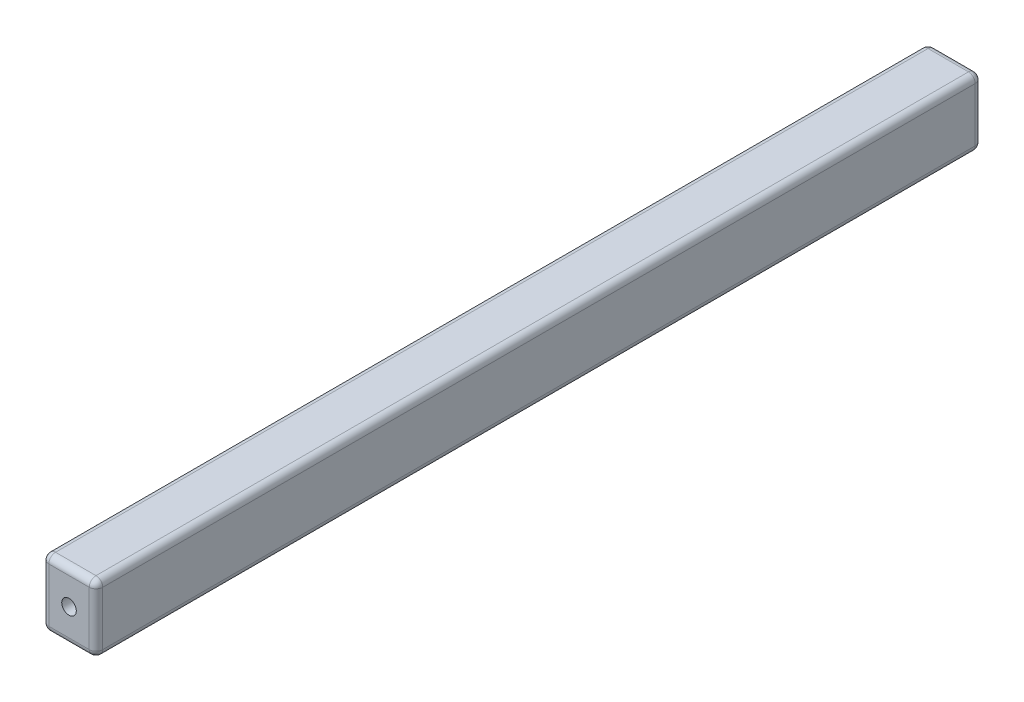
ISO-10303-21;
HEADER;
FILE_DESCRIPTION(('STEP AP214'),'2;1');
FILE_NAME('part.step','',(''),(''),'','','');
FILE_SCHEMA(('AUTOMOTIVE_DESIGN { 1 0 10303 214 1 1 1 1 }'));
ENDSEC;
DATA;
#1=APPLICATION_CONTEXT('core data for automotive mechanical design processes');
#2=APPLICATION_PROTOCOL_DEFINITION('international standard','automotive_design',2000,#1);
#3=PRODUCT_CONTEXT('',#1,'mechanical');
#4=PRODUCT('Part','Part','',(#3));
#5=PRODUCT_RELATED_PRODUCT_CATEGORY('part','',(#4));
#6=PRODUCT_DEFINITION_FORMATION('','',#4);
#7=PRODUCT_DEFINITION_CONTEXT('part definition',#1,'design');
#8=PRODUCT_DEFINITION('design','',#6,#7);
#9=PRODUCT_DEFINITION_SHAPE('','',#8);
#10=(LENGTH_UNIT() NAMED_UNIT(*) SI_UNIT(.MILLI.,.METRE.));
#11=(NAMED_UNIT(*) PLANE_ANGLE_UNIT() SI_UNIT($,.RADIAN.));
#12=(NAMED_UNIT(*) SI_UNIT($,.STERADIAN.) SOLID_ANGLE_UNIT());
#13=UNCERTAINTY_MEASURE_WITH_UNIT(LENGTH_MEASURE(1.E-05),#10,'distance_accuracy_value','');
#14=(GEOMETRIC_REPRESENTATION_CONTEXT(3) GLOBAL_UNCERTAINTY_ASSIGNED_CONTEXT((#13)) GLOBAL_UNIT_ASSIGNED_CONTEXT((#10,
#11,#12)) REPRESENTATION_CONTEXT('',''));
#15=CARTESIAN_POINT('',(0.,0.,0.));
#16=DIRECTION('',(0.,0.,1.));
#17=DIRECTION('',(1.,0.,0.));
#18=AXIS2_PLACEMENT_3D('',#15,#16,#17);
#19=CARTESIAN_POINT('',(-20.,-25.,328.45));
#20=DIRECTION('',(1.,0.,0.));
#21=DIRECTION('',(0.,0.,-1.));
#22=AXIS2_PLACEMENT_3D('',#19,#20,#21);
#23=PLANE('',#22);
#24=DIRECTION('',(0.,-1.,0.));
#25=VECTOR('',#24,1.);
#26=CARTESIAN_POINT('',(-20.,-25.,-323.45));
#27=LINE('',#26,#25);
#28=CARTESIAN_POINT('',(-20.,20.,-323.45));
#29=VERTEX_POINT('',#28);
#30=CARTESIAN_POINT('',(-20.,-20.,-323.45));
#31=VERTEX_POINT('',#30);
#32=EDGE_CURVE('E170',#29,#31,#27,.T.);
#33=ORIENTED_EDGE('',*,*,#32,.T.);
#34=DIRECTION('',(0.,0.,-1.));
#35=VECTOR('',#34,1.);
#36=CARTESIAN_POINT('',(-20.,-20.,328.45));
#37=LINE('',#36,#35);
#38=CARTESIAN_POINT('',(-20.,-20.,323.45));
#39=VERTEX_POINT('',#38);
#40=EDGE_CURVE('E172',#31,#39,#37,.F.);
#41=ORIENTED_EDGE('',*,*,#40,.T.);
#42=DIRECTION('',(0.,-1.,0.));
#43=VECTOR('',#42,1.);
#44=CARTESIAN_POINT('',(-20.,25.,323.45));
#45=LINE('',#44,#43);
#46=CARTESIAN_POINT('',(-20.,20.,323.45));
#47=VERTEX_POINT('',#46);
#48=EDGE_CURVE('E168',#39,#47,#45,.F.);
#49=ORIENTED_EDGE('',*,*,#48,.T.);
#50=DIRECTION('',(0.,0.,-1.));
#51=VECTOR('',#50,1.);
#52=CARTESIAN_POINT('',(-20.,20.,328.45));
#53=LINE('',#52,#51);
#54=EDGE_CURVE('E166',#47,#29,#53,.T.);
#55=ORIENTED_EDGE('',*,*,#54,.T.);
#56=EDGE_LOOP('',(#33,#41,#49,#55));
#57=FACE_BOUND('',#56,.T.);
#58=ADVANCED_FACE('F43',(#57),#23,.F.);
#59=CARTESIAN_POINT('',(20.,-25.,328.45));
#60=DIRECTION('',(0.,1.,0.));
#61=DIRECTION('',(-1.,0.,0.));
#62=AXIS2_PLACEMENT_3D('',#59,#60,#61);
#63=PLANE('',#62);
#64=DIRECTION('',(1.,0.,0.));
#65=VECTOR('',#64,1.);
#66=CARTESIAN_POINT('',(-20.,-25.,323.45));
#67=LINE('',#66,#65);
#68=CARTESIAN_POINT('',(15.,-25.,323.45));
#69=VERTEX_POINT('',#68);
#70=CARTESIAN_POINT('',(-15.,-25.,323.45));
#71=VERTEX_POINT('',#70);
#72=EDGE_CURVE('E159',#69,#71,#67,.F.);
#73=ORIENTED_EDGE('',*,*,#72,.T.);
#74=DIRECTION('',(0.,0.,-1.));
#75=VECTOR('',#74,1.);
#76=CARTESIAN_POINT('',(-15.,-25.,328.45));
#77=LINE('',#76,#75);
#78=CARTESIAN_POINT('',(-15.,-25.,-323.45));
#79=VERTEX_POINT('',#78);
#80=EDGE_CURVE('E163',#71,#79,#77,.T.);
#81=ORIENTED_EDGE('',*,*,#80,.T.);
#82=DIRECTION('',(1.,0.,0.));
#83=VECTOR('',#82,1.);
#84=CARTESIAN_POINT('',(20.,-25.,-323.45));
#85=LINE('',#84,#83);
#86=CARTESIAN_POINT('',(15.,-25.,-323.45));
#87=VERTEX_POINT('',#86);
#88=EDGE_CURVE('E161',#79,#87,#85,.T.);
#89=ORIENTED_EDGE('',*,*,#88,.T.);
#90=DIRECTION('',(0.,0.,-1.));
#91=VECTOR('',#90,1.);
#92=CARTESIAN_POINT('',(15.,-25.,328.45));
#93=LINE('',#92,#91);
#94=EDGE_CURVE('E157',#87,#69,#93,.F.);
#95=ORIENTED_EDGE('',*,*,#94,.T.);
#96=EDGE_LOOP('',(#73,#81,#89,#95));
#97=FACE_BOUND('',#96,.T.);
#98=ADVANCED_FACE('F355',(#97),#63,.F.);
#99=CARTESIAN_POINT('',(20.,-25.,328.45));
#100=DIRECTION('',(-1.,0.,0.));
#101=DIRECTION('',(0.,0.,1.));
#102=AXIS2_PLACEMENT_3D('',#99,#100,#101);
#103=PLANE('',#102);
#104=DIRECTION('',(0.,1.,0.));
#105=VECTOR('',#104,1.);
#106=CARTESIAN_POINT('',(20.,-25.,323.45));
#107=LINE('',#106,#105);
#108=CARTESIAN_POINT('',(20.,20.,323.45));
#109=VERTEX_POINT('',#108);
#110=CARTESIAN_POINT('',(20.,-20.,323.45));
#111=VERTEX_POINT('',#110);
#112=EDGE_CURVE('E197',#109,#111,#107,.F.);
#113=ORIENTED_EDGE('',*,*,#112,.T.);
#114=DIRECTION('',(0.,0.,-1.));
#115=VECTOR('',#114,1.);
#116=CARTESIAN_POINT('',(20.,-20.,328.45));
#117=LINE('',#116,#115);
#118=CARTESIAN_POINT('',(20.,-20.,-323.45));
#119=VERTEX_POINT('',#118);
#120=EDGE_CURVE('E199',#111,#119,#117,.T.);
#121=ORIENTED_EDGE('',*,*,#120,.T.);
#122=DIRECTION('',(0.,1.,0.));
#123=VECTOR('',#122,1.);
#124=CARTESIAN_POINT('',(20.,-25.,-323.45));
#125=LINE('',#124,#123);
#126=CARTESIAN_POINT('',(20.,20.,-323.45));
#127=VERTEX_POINT('',#126);
#128=EDGE_CURVE('E195',#119,#127,#125,.T.);
#129=ORIENTED_EDGE('',*,*,#128,.T.);
#130=DIRECTION('',(0.,0.,-1.));
#131=VECTOR('',#130,1.);
#132=CARTESIAN_POINT('',(20.,20.,328.45));
#133=LINE('',#132,#131);
#134=EDGE_CURVE('E193',#127,#109,#133,.F.);
#135=ORIENTED_EDGE('',*,*,#134,.T.);
#136=EDGE_LOOP('',(#113,#121,#129,#135));
#137=FACE_BOUND('',#136,.T.);
#138=ADVANCED_FACE('F296',(#137),#103,.F.);
#139=CARTESIAN_POINT('',(20.,25.,328.45));
#140=DIRECTION('',(0.,-1.,0.));
#141=DIRECTION('',(1.,0.,0.));
#142=AXIS2_PLACEMENT_3D('',#139,#140,#141);
#143=PLANE('',#142);
#144=DIRECTION('',(-1.,0.,0.));
#145=VECTOR('',#144,1.);
#146=CARTESIAN_POINT('',(20.,25.,323.45));
#147=LINE('',#146,#145);
#148=CARTESIAN_POINT('',(-15.,25.,323.45));
#149=VERTEX_POINT('',#148);
#150=CARTESIAN_POINT('',(15.,25.,323.45));
#151=VERTEX_POINT('',#150);
#152=EDGE_CURVE('E52',#149,#151,#147,.F.);
#153=ORIENTED_EDGE('',*,*,#152,.T.);
#154=DIRECTION('',(0.,0.,-1.));
#155=VECTOR('',#154,1.);
#156=CARTESIAN_POINT('',(15.,25.,328.45));
#157=LINE('',#156,#155);
#158=CARTESIAN_POINT('',(15.,25.,-323.45));
#159=VERTEX_POINT('',#158);
#160=EDGE_CURVE('E11',#151,#159,#157,.T.);
#161=ORIENTED_EDGE('',*,*,#160,.T.);
#162=DIRECTION('',(-1.,0.,0.));
#163=VECTOR('',#162,1.);
#164=CARTESIAN_POINT('',(20.,25.,-323.45));
#165=LINE('',#164,#163);
#166=CARTESIAN_POINT('',(-15.,25.,-323.45));
#167=VERTEX_POINT('',#166);
#168=EDGE_CURVE('E202',#159,#167,#165,.T.);
#169=ORIENTED_EDGE('',*,*,#168,.T.);
#170=DIRECTION('',(0.,0.,-1.));
#171=VECTOR('',#170,1.);
#172=CARTESIAN_POINT('',(-15.,25.,328.45));
#173=LINE('',#172,#171);
#174=EDGE_CURVE('E63',#167,#149,#173,.F.);
#175=ORIENTED_EDGE('',*,*,#174,.T.);
#176=EDGE_LOOP('',(#153,#161,#169,#175));
#177=FACE_BOUND('',#176,.T.);
#178=ADVANCED_FACE('F310',(#177),#143,.F.);
#179=CARTESIAN_POINT('',(0.,0.,328.45));
#180=DIRECTION('',(0.,0.,1.));
#181=DIRECTION('',(1.,0.,0.));
#182=AXIS2_PLACEMENT_3D('',#179,#180,#181);
#183=PLANE('',#182);
#184=CARTESIAN_POINT('',(0.,0.,328.45));
#185=DIRECTION('',(0.,0.,1.));
#186=DIRECTION('',(1.,0.,0.));
#187=AXIS2_PLACEMENT_3D('',#184,#185,#186);
#188=CIRCLE('',#187,5.4);
#189=CARTESIAN_POINT('',(5.4,0.,328.45));
#190=VERTEX_POINT('',#189);
#191=EDGE_CURVE('E145',#190,#190,#188,.T.);
#192=ORIENTED_EDGE('',*,*,#191,.F.);
#193=EDGE_LOOP('',(#192));
#194=FACE_BOUND('',#193,.T.);
#195=DIRECTION('',(0.,-1.,0.));
#196=VECTOR('',#195,1.);
#197=CARTESIAN_POINT('',(-15.,-25.,328.45));
#198=LINE('',#197,#196);
#199=CARTESIAN_POINT('',(-15.,20.,328.45));
#200=VERTEX_POINT('',#199);
#201=CARTESIAN_POINT('',(-15.,-20.,328.45));
#202=VERTEX_POINT('',#201);
#203=EDGE_CURVE('E188',#200,#202,#198,.T.);
#204=ORIENTED_EDGE('',*,*,#203,.T.);
#205=DIRECTION('',(1.,0.,0.));
#206=VECTOR('',#205,1.);
#207=CARTESIAN_POINT('',(20.,-20.,328.45));
#208=LINE('',#207,#206);
#209=CARTESIAN_POINT('',(15.,-20.,328.45));
#210=VERTEX_POINT('',#209);
#211=EDGE_CURVE('E190',#202,#210,#208,.T.);
#212=ORIENTED_EDGE('',*,*,#211,.T.);
#213=DIRECTION('',(0.,1.,0.));
#214=VECTOR('',#213,1.);
#215=CARTESIAN_POINT('',(15.,25.,328.45));
#216=LINE('',#215,#214);
#217=CARTESIAN_POINT('',(15.,20.,328.45));
#218=VERTEX_POINT('',#217);
#219=EDGE_CURVE('E186',#210,#218,#216,.T.);
#220=ORIENTED_EDGE('',*,*,#219,.T.);
#221=DIRECTION('',(-1.,0.,0.));
#222=VECTOR('',#221,1.);
#223=CARTESIAN_POINT('',(-20.,20.,328.45));
#224=LINE('',#223,#222);
#225=EDGE_CURVE('E184',#218,#200,#224,.T.);
#226=ORIENTED_EDGE('',*,*,#225,.T.);
#227=EDGE_LOOP('',(#204,#212,#220,#226));
#228=FACE_BOUND('',#227,.T.);
#229=ADVANCED_FACE('F287',(#194,#228),#183,.T.);
#230=CARTESIAN_POINT('',(0.,0.,-328.45));
#231=DIRECTION('',(0.,0.,1.));
#232=DIRECTION('',(1.,0.,0.));
#233=AXIS2_PLACEMENT_3D('',#230,#231,#232);
#234=PLANE('',#233);
#235=CARTESIAN_POINT('',(0.,0.,-328.45));
#236=DIRECTION('',(0.,0.,-1.));
#237=DIRECTION('',(-1.,0.,0.));
#238=AXIS2_PLACEMENT_3D('',#235,#236,#237);
#239=CIRCLE('',#238,5.4);
#240=CARTESIAN_POINT('',(-5.4,0.,-328.45));
#241=VERTEX_POINT('',#240);
#242=EDGE_CURVE('E146',#241,#241,#239,.T.);
#243=ORIENTED_EDGE('',*,*,#242,.F.);
#244=EDGE_LOOP('',(#243));
#245=FACE_BOUND('',#244,.T.);
#246=DIRECTION('',(0.,1.,0.));
#247=VECTOR('',#246,1.);
#248=CARTESIAN_POINT('',(15.,0.,-328.45));
#249=LINE('',#248,#247);
#250=CARTESIAN_POINT('',(15.,20.,-328.45));
#251=VERTEX_POINT('',#250);
#252=CARTESIAN_POINT('',(15.,-20.,-328.45));
#253=VERTEX_POINT('',#252);
#254=EDGE_CURVE('E177',#251,#253,#249,.F.);
#255=ORIENTED_EDGE('',*,*,#254,.T.);
#256=DIRECTION('',(1.,0.,0.));
#257=VECTOR('',#256,1.);
#258=CARTESIAN_POINT('',(0.,-20.,-328.45));
#259=LINE('',#258,#257);
#260=CARTESIAN_POINT('',(-15.,-20.,-328.45));
#261=VERTEX_POINT('',#260);
#262=EDGE_CURVE('E181',#253,#261,#259,.F.);
#263=ORIENTED_EDGE('',*,*,#262,.T.);
#264=DIRECTION('',(0.,-1.,0.));
#265=VECTOR('',#264,1.);
#266=CARTESIAN_POINT('',(-15.,0.,-328.45));
#267=LINE('',#266,#265);
#268=CARTESIAN_POINT('',(-15.,20.,-328.45));
#269=VERTEX_POINT('',#268);
#270=EDGE_CURVE('E179',#261,#269,#267,.F.);
#271=ORIENTED_EDGE('',*,*,#270,.T.);
#272=DIRECTION('',(-1.,0.,0.));
#273=VECTOR('',#272,1.);
#274=CARTESIAN_POINT('',(0.,20.,-328.45));
#275=LINE('',#274,#273);
#276=EDGE_CURVE('E175',#269,#251,#275,.F.);
#277=ORIENTED_EDGE('',*,*,#276,.T.);
#278=EDGE_LOOP('',(#255,#263,#271,#277));
#279=FACE_BOUND('',#278,.T.);
#280=ADVANCED_FACE('F433',(#245,#279),#234,.F.);
#281=CARTESIAN_POINT('',(15.,20.,328.45));
#282=DIRECTION('',(0.,0.,-1.));
#283=DIRECTION('',(-1.,0.,0.));
#284=AXIS2_PLACEMENT_3D('',#281,#282,#283);
#285=CYLINDRICAL_SURFACE('',#284,5.);
#286=CARTESIAN_POINT('',(15.,20.,323.45));
#287=DIRECTION('',(0.,0.,1.));
#288=DIRECTION('',(1.,0.,0.));
#289=AXIS2_PLACEMENT_3D('',#286,#287,#288);
#290=CIRCLE('',#289,5.);
#291=EDGE_CURVE('E47',#109,#151,#290,.T.);
#292=ORIENTED_EDGE('',*,*,#291,.F.);
#293=ORIENTED_EDGE('',*,*,#134,.F.);
#294=CARTESIAN_POINT('',(15.,20.,-323.45));
#295=DIRECTION('',(0.,0.,-1.));
#296=DIRECTION('',(-1.,0.,0.));
#297=AXIS2_PLACEMENT_3D('',#294,#295,#296);
#298=CIRCLE('',#297,5.);
#299=EDGE_CURVE('E265',#159,#127,#298,.T.);
#300=ORIENTED_EDGE('',*,*,#299,.F.);
#301=ORIENTED_EDGE('',*,*,#160,.F.);
#302=EDGE_LOOP('',(#292,#293,#300,#301));
#303=FACE_BOUND('',#302,.T.);
#304=ADVANCED_FACE('F45',(#303),#285,.T.);
#305=CARTESIAN_POINT('',(15.,20.,323.45));
#306=DIRECTION('',(0.,1.,0.));
#307=DIRECTION('',(-1.,0.,0.));
#308=AXIS2_PLACEMENT_3D('',#305,#306,#307);
#309=SPHERICAL_SURFACE('',#308,5.);
#310=CARTESIAN_POINT('',(15.,20.,323.45));
#311=DIRECTION('',(0.,1.,0.));
#312=DIRECTION('',(-1.,0.,0.));
#313=AXIS2_PLACEMENT_3D('',#310,#311,#312);
#314=CIRCLE('',#313,5.);
#315=EDGE_CURVE('E260',#109,#218,#314,.F.);
#316=ORIENTED_EDGE('',*,*,#315,.F.);
#317=ORIENTED_EDGE('',*,*,#291,.T.);
#318=CARTESIAN_POINT('',(15.,20.,323.45));
#319=DIRECTION('',(1.,0.,0.));
#320=DIRECTION('',(0.,0.,-1.));
#321=AXIS2_PLACEMENT_3D('',#318,#319,#320);
#322=CIRCLE('',#321,5.);
#323=EDGE_CURVE('E263',#218,#151,#322,.F.);
#324=ORIENTED_EDGE('',*,*,#323,.F.);
#325=EDGE_LOOP('',(#316,#317,#324));
#326=FACE_BOUND('',#325,.T.);
#327=ADVANCED_FACE('F276',(#326),#309,.T.);
#328=CARTESIAN_POINT('',(15.,20.,-323.45));
#329=DIRECTION('',(1.,0.,0.));
#330=DIRECTION('',(0.,0.,-1.));
#331=AXIS2_PLACEMENT_3D('',#328,#329,#330);
#332=SPHERICAL_SURFACE('',#331,5.);
#333=CARTESIAN_POINT('',(15.,20.,-323.45));
#334=DIRECTION('',(1.,0.,0.));
#335=DIRECTION('',(0.,1.,0.));
#336=AXIS2_PLACEMENT_3D('',#333,#334,#335);
#337=CIRCLE('',#336,5.);
#338=EDGE_CURVE('E254',#159,#251,#337,.F.);
#339=ORIENTED_EDGE('',*,*,#338,.F.);
#340=ORIENTED_EDGE('',*,*,#299,.T.);
#341=CARTESIAN_POINT('',(15.,20.,-323.45));
#342=DIRECTION('',(0.,1.,0.));
#343=DIRECTION('',(0.,0.,1.));
#344=AXIS2_PLACEMENT_3D('',#341,#342,#343);
#345=CIRCLE('',#344,5.);
#346=EDGE_CURVE('E257',#251,#127,#345,.F.);
#347=ORIENTED_EDGE('',*,*,#346,.F.);
#348=EDGE_LOOP('',(#339,#340,#347));
#349=FACE_BOUND('',#348,.T.);
#350=ADVANCED_FACE('F540',(#349),#332,.T.);
#351=CARTESIAN_POINT('',(0.,20.,323.45));
#352=DIRECTION('',(1.,0.,0.));
#353=DIRECTION('',(0.,1.,0.));
#354=AXIS2_PLACEMENT_3D('',#351,#352,#353);
#355=CYLINDRICAL_SURFACE('',#354,5.);
#356=ORIENTED_EDGE('',*,*,#323,.T.);
#357=ORIENTED_EDGE('',*,*,#152,.F.);
#358=CARTESIAN_POINT('',(-15.,20.,323.45));
#359=DIRECTION('',(-1.,0.,0.));
#360=DIRECTION('',(0.,0.,1.));
#361=AXIS2_PLACEMENT_3D('',#358,#359,#360);
#362=CIRCLE('',#361,5.);
#363=EDGE_CURVE('E248',#200,#149,#362,.T.);
#364=ORIENTED_EDGE('',*,*,#363,.F.);
#365=ORIENTED_EDGE('',*,*,#225,.F.);
#366=EDGE_LOOP('',(#356,#357,#364,#365));
#367=FACE_BOUND('',#366,.T.);
#368=ADVANCED_FACE('F282',(#367),#355,.T.);
#369=CARTESIAN_POINT('',(15.,0.,323.45));
#370=DIRECTION('',(0.,-1.,0.));
#371=DIRECTION('',(0.,0.,-1.));
#372=AXIS2_PLACEMENT_3D('',#369,#370,#371);
#373=CYLINDRICAL_SURFACE('',#372,5.);
#374=ORIENTED_EDGE('',*,*,#315,.T.);
#375=ORIENTED_EDGE('',*,*,#219,.F.);
#376=CARTESIAN_POINT('',(15.,-20.,323.45));
#377=DIRECTION('',(0.,-1.,0.));
#378=DIRECTION('',(0.,0.,-1.));
#379=AXIS2_PLACEMENT_3D('',#376,#377,#378);
#380=CIRCLE('',#379,5.);
#381=EDGE_CURVE('E245',#111,#210,#380,.T.);
#382=ORIENTED_EDGE('',*,*,#381,.F.);
#383=ORIENTED_EDGE('',*,*,#112,.F.);
#384=EDGE_LOOP('',(#374,#375,#382,#383));
#385=FACE_BOUND('',#384,.T.);
#386=ADVANCED_FACE('F293',(#385),#373,.T.);
#387=CARTESIAN_POINT('',(15.,-20.,328.45));
#388=DIRECTION('',(0.,0.,-1.));
#389=DIRECTION('',(-1.,0.,0.));
#390=AXIS2_PLACEMENT_3D('',#387,#388,#389);
#391=CYLINDRICAL_SURFACE('',#390,5.);
#392=CARTESIAN_POINT('',(15.,-20.,-323.45));
#393=DIRECTION('',(0.,0.,-1.));
#394=DIRECTION('',(-1.,0.,0.));
#395=AXIS2_PLACEMENT_3D('',#392,#393,#394);
#396=CIRCLE('',#395,5.);
#397=EDGE_CURVE('E239',#119,#87,#396,.T.);
#398=ORIENTED_EDGE('',*,*,#397,.F.);
#399=ORIENTED_EDGE('',*,*,#120,.F.);
#400=CARTESIAN_POINT('',(15.,-20.,323.45));
#401=DIRECTION('',(0.,0.,1.));
#402=DIRECTION('',(1.,0.,0.));
#403=AXIS2_PLACEMENT_3D('',#400,#401,#402);
#404=CIRCLE('',#403,5.);
#405=EDGE_CURVE('E242',#69,#111,#404,.T.);
#406=ORIENTED_EDGE('',*,*,#405,.F.);
#407=ORIENTED_EDGE('',*,*,#94,.F.);
#408=EDGE_LOOP('',(#398,#399,#406,#407));
#409=FACE_BOUND('',#408,.T.);
#410=ADVANCED_FACE('F300',(#409),#391,.T.);
#411=CARTESIAN_POINT('',(15.,-25.,-323.45));
#412=DIRECTION('',(0.,1.,0.));
#413=DIRECTION('',(0.,0.,1.));
#414=AXIS2_PLACEMENT_3D('',#411,#412,#413);
#415=CYLINDRICAL_SURFACE('',#414,5.);
#416=ORIENTED_EDGE('',*,*,#346,.T.);
#417=ORIENTED_EDGE('',*,*,#128,.F.);
#418=CARTESIAN_POINT('',(15.,-20.,-323.45));
#419=DIRECTION('',(0.,-1.,0.));
#420=DIRECTION('',(0.,0.,-1.));
#421=AXIS2_PLACEMENT_3D('',#418,#419,#420);
#422=CIRCLE('',#421,5.);
#423=EDGE_CURVE('E237',#253,#119,#422,.T.);
#424=ORIENTED_EDGE('',*,*,#423,.F.);
#425=ORIENTED_EDGE('',*,*,#254,.F.);
#426=EDGE_LOOP('',(#416,#417,#424,#425));
#427=FACE_BOUND('',#426,.T.);
#428=ADVANCED_FACE('F308',(#427),#415,.T.);
#429=CARTESIAN_POINT('',(20.,20.,-323.45));
#430=DIRECTION('',(-1.,0.,0.));
#431=DIRECTION('',(0.,-1.,0.));
#432=AXIS2_PLACEMENT_3D('',#429,#430,#431);
#433=CYLINDRICAL_SURFACE('',#432,5.);
#434=ORIENTED_EDGE('',*,*,#338,.T.);
#435=ORIENTED_EDGE('',*,*,#276,.F.);
#436=CARTESIAN_POINT('',(-15.,20.,-323.45));
#437=DIRECTION('',(-1.,0.,0.));
#438=DIRECTION('',(0.,0.,1.));
#439=AXIS2_PLACEMENT_3D('',#436,#437,#438);
#440=CIRCLE('',#439,5.);
#441=EDGE_CURVE('E234',#167,#269,#440,.T.);
#442=ORIENTED_EDGE('',*,*,#441,.F.);
#443=ORIENTED_EDGE('',*,*,#168,.F.);
#444=EDGE_LOOP('',(#434,#435,#442,#443));
#445=FACE_BOUND('',#444,.T.);
#446=ADVANCED_FACE('F319',(#445),#433,.T.);
#447=CARTESIAN_POINT('',(-15.,20.,328.45));
#448=DIRECTION('',(0.,0.,-1.));
#449=DIRECTION('',(-1.,0.,0.));
#450=AXIS2_PLACEMENT_3D('',#447,#448,#449);
#451=CYLINDRICAL_SURFACE('',#450,5.);
#452=CARTESIAN_POINT('',(-15.,20.,323.45));
#453=DIRECTION('',(0.,0.,1.));
#454=DIRECTION('',(1.,0.,0.));
#455=AXIS2_PLACEMENT_3D('',#452,#453,#454);
#456=CIRCLE('',#455,5.);
#457=EDGE_CURVE('E251',#149,#47,#456,.T.);
#458=ORIENTED_EDGE('',*,*,#457,.F.);
#459=ORIENTED_EDGE('',*,*,#174,.F.);
#460=CARTESIAN_POINT('',(-15.,20.,-323.45));
#461=DIRECTION('',(0.,0.,-1.));
#462=DIRECTION('',(-1.,0.,0.));
#463=AXIS2_PLACEMENT_3D('',#460,#461,#462);
#464=CIRCLE('',#463,5.);
#465=EDGE_CURVE('E231',#29,#167,#464,.T.);
#466=ORIENTED_EDGE('',*,*,#465,.F.);
#467=ORIENTED_EDGE('',*,*,#54,.F.);
#468=EDGE_LOOP('',(#458,#459,#466,#467));
#469=FACE_BOUND('',#468,.T.);
#470=ADVANCED_FACE('F315',(#469),#451,.T.);
#471=CARTESIAN_POINT('',(-15.,20.,323.45));
#472=DIRECTION('',(0.,1.,0.));
#473=DIRECTION('',(0.,0.,1.));
#474=AXIS2_PLACEMENT_3D('',#471,#472,#473);
#475=SPHERICAL_SURFACE('',#474,5.);
#476=ORIENTED_EDGE('',*,*,#363,.T.);
#477=ORIENTED_EDGE('',*,*,#457,.T.);
#478=CARTESIAN_POINT('',(-15.,20.,323.45));
#479=DIRECTION('',(0.,1.,0.));
#480=DIRECTION('',(0.,0.,1.));
#481=AXIS2_PLACEMENT_3D('',#478,#479,#480);
#482=CIRCLE('',#481,5.);
#483=EDGE_CURVE('E228',#200,#47,#482,.F.);
#484=ORIENTED_EDGE('',*,*,#483,.F.);
#485=EDGE_LOOP('',(#476,#477,#484));
#486=FACE_BOUND('',#485,.T.);
#487=ADVANCED_FACE('F331',(#486),#475,.T.);
#488=CARTESIAN_POINT('',(15.,-20.,323.45));
#489=DIRECTION('',(1.,0.,0.));
#490=DIRECTION('',(0.,0.,-1.));
#491=AXIS2_PLACEMENT_3D('',#488,#489,#490);
#492=SPHERICAL_SURFACE('',#491,5.);
#493=ORIENTED_EDGE('',*,*,#405,.T.);
#494=ORIENTED_EDGE('',*,*,#381,.T.);
#495=CARTESIAN_POINT('',(15.,-20.,323.45));
#496=DIRECTION('',(1.,0.,0.));
#497=DIRECTION('',(0.,0.,-1.));
#498=AXIS2_PLACEMENT_3D('',#495,#496,#497);
#499=CIRCLE('',#498,5.);
#500=EDGE_CURVE('E226',#69,#210,#499,.F.);
#501=ORIENTED_EDGE('',*,*,#500,.F.);
#502=EDGE_LOOP('',(#493,#494,#501));
#503=FACE_BOUND('',#502,.T.);
#504=ADVANCED_FACE('F344',(#503),#492,.T.);
#505=CARTESIAN_POINT('',(15.,-20.,-323.45));
#506=DIRECTION('',(1.,0.,0.));
#507=DIRECTION('',(0.,0.,-1.));
#508=AXIS2_PLACEMENT_3D('',#505,#506,#507);
#509=SPHERICAL_SURFACE('',#508,5.);
#510=ORIENTED_EDGE('',*,*,#423,.T.);
#511=ORIENTED_EDGE('',*,*,#397,.T.);
#512=CARTESIAN_POINT('',(15.,-20.,-323.45));
#513=DIRECTION('',(1.,0.,0.));
#514=DIRECTION('',(0.,0.,-1.));
#515=AXIS2_PLACEMENT_3D('',#512,#513,#514);
#516=CIRCLE('',#515,5.);
#517=EDGE_CURVE('E223',#253,#87,#516,.F.);
#518=ORIENTED_EDGE('',*,*,#517,.F.);
#519=EDGE_LOOP('',(#510,#511,#518));
#520=FACE_BOUND('',#519,.T.);
#521=ADVANCED_FACE('F346',(#520),#509,.T.);
#522=CARTESIAN_POINT('',(-15.,20.,-323.45));
#523=DIRECTION('',(0.,1.,0.));
#524=DIRECTION('',(0.,0.,1.));
#525=AXIS2_PLACEMENT_3D('',#522,#523,#524);
#526=SPHERICAL_SURFACE('',#525,5.);
#527=ORIENTED_EDGE('',*,*,#465,.T.);
#528=ORIENTED_EDGE('',*,*,#441,.T.);
#529=CARTESIAN_POINT('',(-15.,20.,-323.45));
#530=DIRECTION('',(0.,1.,0.));
#531=DIRECTION('',(-1.,0.,0.));
#532=AXIS2_PLACEMENT_3D('',#529,#530,#531);
#533=CIRCLE('',#532,5.);
#534=EDGE_CURVE('E220',#29,#269,#533,.F.);
#535=ORIENTED_EDGE('',*,*,#534,.F.);
#536=EDGE_LOOP('',(#527,#528,#535));
#537=FACE_BOUND('',#536,.T.);
#538=ADVANCED_FACE('F321',(#537),#526,.T.);
#539=CARTESIAN_POINT('',(-15.,0.,323.45));
#540=DIRECTION('',(0.,1.,0.));
#541=DIRECTION('',(0.,0.,1.));
#542=AXIS2_PLACEMENT_3D('',#539,#540,#541);
#543=CYLINDRICAL_SURFACE('',#542,5.);
#544=ORIENTED_EDGE('',*,*,#483,.T.);
#545=ORIENTED_EDGE('',*,*,#48,.F.);
#546=CARTESIAN_POINT('',(-15.,-20.,323.45));
#547=DIRECTION('',(0.,-1.,0.));
#548=DIRECTION('',(0.,0.,-1.));
#549=AXIS2_PLACEMENT_3D('',#546,#547,#548);
#550=CIRCLE('',#549,5.);
#551=EDGE_CURVE('E217',#202,#39,#550,.T.);
#552=ORIENTED_EDGE('',*,*,#551,.F.);
#553=ORIENTED_EDGE('',*,*,#203,.F.);
#554=EDGE_LOOP('',(#544,#545,#552,#553));
#555=FACE_BOUND('',#554,.T.);
#556=ADVANCED_FACE('F333',(#555),#543,.T.);
#557=CARTESIAN_POINT('',(0.,-20.,323.45));
#558=DIRECTION('',(-1.,0.,0.));
#559=DIRECTION('',(0.,-1.,0.));
#560=AXIS2_PLACEMENT_3D('',#557,#558,#559);
#561=CYLINDRICAL_SURFACE('',#560,5.);
#562=ORIENTED_EDGE('',*,*,#500,.T.);
#563=ORIENTED_EDGE('',*,*,#211,.F.);
#564=CARTESIAN_POINT('',(-15.,-20.,323.45));
#565=DIRECTION('',(-1.,0.,0.));
#566=DIRECTION('',(0.,0.,1.));
#567=AXIS2_PLACEMENT_3D('',#564,#565,#566);
#568=CIRCLE('',#567,5.);
#569=EDGE_CURVE('E214',#71,#202,#568,.T.);
#570=ORIENTED_EDGE('',*,*,#569,.F.);
#571=ORIENTED_EDGE('',*,*,#72,.F.);
#572=EDGE_LOOP('',(#562,#563,#570,#571));
#573=FACE_BOUND('',#572,.T.);
#574=ADVANCED_FACE('F342',(#573),#561,.T.);
#575=CARTESIAN_POINT('',(20.,-20.,-323.45));
#576=DIRECTION('',(1.,0.,0.));
#577=DIRECTION('',(0.,1.,0.));
#578=AXIS2_PLACEMENT_3D('',#575,#576,#577);
#579=CYLINDRICAL_SURFACE('',#578,5.);
#580=ORIENTED_EDGE('',*,*,#517,.T.);
#581=ORIENTED_EDGE('',*,*,#88,.F.);
#582=CARTESIAN_POINT('',(-15.,-20.,-323.45));
#583=DIRECTION('',(-1.,0.,0.));
#584=DIRECTION('',(0.,-1.,0.));
#585=AXIS2_PLACEMENT_3D('',#582,#583,#584);
#586=CIRCLE('',#585,5.);
#587=EDGE_CURVE('E211',#261,#79,#586,.T.);
#588=ORIENTED_EDGE('',*,*,#587,.F.);
#589=ORIENTED_EDGE('',*,*,#262,.F.);
#590=EDGE_LOOP('',(#580,#581,#588,#589));
#591=FACE_BOUND('',#590,.T.);
#592=ADVANCED_FACE('F377',(#591),#579,.T.);
#593=CARTESIAN_POINT('',(-15.,-25.,-323.45));
#594=DIRECTION('',(0.,-1.,0.));
#595=DIRECTION('',(0.,0.,-1.));
#596=AXIS2_PLACEMENT_3D('',#593,#594,#595);
#597=CYLINDRICAL_SURFACE('',#596,5.);
#598=ORIENTED_EDGE('',*,*,#534,.T.);
#599=ORIENTED_EDGE('',*,*,#270,.F.);
#600=CARTESIAN_POINT('',(-15.,-20.,-323.45));
#601=DIRECTION('',(0.,-1.,0.));
#602=DIRECTION('',(0.,0.,-1.));
#603=AXIS2_PLACEMENT_3D('',#600,#601,#602);
#604=CIRCLE('',#603,5.);
#605=EDGE_CURVE('E209',#31,#261,#604,.T.);
#606=ORIENTED_EDGE('',*,*,#605,.F.);
#607=ORIENTED_EDGE('',*,*,#32,.F.);
#608=EDGE_LOOP('',(#598,#599,#606,#607));
#609=FACE_BOUND('',#608,.T.);
#610=ADVANCED_FACE('F326',(#609),#597,.T.);
#611=CARTESIAN_POINT('',(-15.,-20.,323.45));
#612=DIRECTION('',(0.,0.,1.));
#613=DIRECTION('',(1.,0.,0.));
#614=AXIS2_PLACEMENT_3D('',#611,#612,#613);
#615=SPHERICAL_SURFACE('',#614,5.);
#616=ORIENTED_EDGE('',*,*,#569,.T.);
#617=ORIENTED_EDGE('',*,*,#551,.T.);
#618=CARTESIAN_POINT('',(-15.,-20.,323.45));
#619=DIRECTION('',(0.,0.,1.));
#620=DIRECTION('',(1.,0.,0.));
#621=AXIS2_PLACEMENT_3D('',#618,#619,#620);
#622=CIRCLE('',#621,5.);
#623=EDGE_CURVE('E207',#71,#39,#622,.F.);
#624=ORIENTED_EDGE('',*,*,#623,.F.);
#625=EDGE_LOOP('',(#616,#617,#624));
#626=FACE_BOUND('',#625,.T.);
#627=ADVANCED_FACE('F338',(#626),#615,.T.);
#628=CARTESIAN_POINT('',(-15.,-20.,-323.45));
#629=DIRECTION('',(0.,0.,-1.));
#630=DIRECTION('',(-1.,0.,0.));
#631=AXIS2_PLACEMENT_3D('',#628,#629,#630);
#632=SPHERICAL_SURFACE('',#631,5.);
#633=ORIENTED_EDGE('',*,*,#605,.T.);
#634=ORIENTED_EDGE('',*,*,#587,.T.);
#635=CARTESIAN_POINT('',(-15.,-20.,-323.45));
#636=DIRECTION('',(0.,0.,-1.));
#637=DIRECTION('',(-1.,0.,0.));
#638=AXIS2_PLACEMENT_3D('',#635,#636,#637);
#639=CIRCLE('',#638,5.);
#640=EDGE_CURVE('E156',#31,#79,#639,.F.);
#641=ORIENTED_EDGE('',*,*,#640,.F.);
#642=EDGE_LOOP('',(#633,#634,#641));
#643=FACE_BOUND('',#642,.T.);
#644=ADVANCED_FACE('F368',(#643),#632,.T.);
#645=CARTESIAN_POINT('',(-15.,-20.,328.45));
#646=DIRECTION('',(0.,0.,-1.));
#647=DIRECTION('',(-1.,0.,0.));
#648=AXIS2_PLACEMENT_3D('',#645,#646,#647);
#649=CYLINDRICAL_SURFACE('',#648,5.);
#650=ORIENTED_EDGE('',*,*,#623,.T.);
#651=ORIENTED_EDGE('',*,*,#40,.F.);
#652=ORIENTED_EDGE('',*,*,#640,.T.);
#653=ORIENTED_EDGE('',*,*,#80,.F.);
#654=EDGE_LOOP('',(#650,#651,#652,#653));
#655=FACE_BOUND('',#654,.T.);
#656=ADVANCED_FACE('F364',(#655),#649,.T.);
#657=CARTESIAN_POINT('',(0.,0.,318.45));
#658=DIRECTION('',(0.,0.,1.));
#659=DIRECTION('',(1.,0.,0.));
#660=AXIS2_PLACEMENT_3D('',#657,#658,#659);
#661=CONICAL_SURFACE('',#660,5.4,1.02974425867665);
#662=CARTESIAN_POINT('',(0.,0.,315.205352657251));
#663=VERTEX_POINT('',#662);
#664=VERTEX_LOOP('',#663);
#665=FACE_BOUND('',#664,.T.);
#666=CARTESIAN_POINT('',(0.,0.,318.45));
#667=DIRECTION('',(0.,0.,1.));
#668=DIRECTION('',(1.,0.,0.));
#669=AXIS2_PLACEMENT_3D('',#666,#667,#668);
#670=CIRCLE('',#669,5.4);
#671=CARTESIAN_POINT('',(5.4,0.,318.45));
#672=VERTEX_POINT('',#671);
#673=EDGE_CURVE('E149',#672,#672,#670,.T.);
#674=ORIENTED_EDGE('',*,*,#673,.T.);
#675=EDGE_LOOP('',(#674));
#676=FACE_BOUND('',#675,.T.);
#677=ADVANCED_FACE('F367',(#665,#676),#661,.F.);
#678=CARTESIAN_POINT('',(0.,0.,328.45));
#679=DIRECTION('',(0.,0.,1.));
#680=DIRECTION('',(1.,0.,0.));
#681=AXIS2_PLACEMENT_3D('',#678,#679,#680);
#682=CYLINDRICAL_SURFACE('',#681,5.4);
#683=ORIENTED_EDGE('',*,*,#673,.F.);
#684=EDGE_LOOP('',(#683));
#685=FACE_BOUND('',#684,.T.);
#686=ORIENTED_EDGE('',*,*,#191,.T.);
#687=EDGE_LOOP('',(#686));
#688=FACE_BOUND('',#687,.T.);
#689=ADVANCED_FACE('F139',(#685,#688),#682,.F.);
#690=CARTESIAN_POINT('',(0.,0.,-318.45));
#691=DIRECTION('',(0.,0.,-1.));
#692=DIRECTION('',(-1.,0.,0.));
#693=AXIS2_PLACEMENT_3D('',#690,#691,#692);
#694=CONICAL_SURFACE('',#693,5.4,1.02974425867665);
#695=CARTESIAN_POINT('',(0.,0.,-315.205352657251));
#696=VERTEX_POINT('',#695);
#697=VERTEX_LOOP('',#696);
#698=FACE_BOUND('',#697,.T.);
#699=CARTESIAN_POINT('',(0.,0.,-318.45));
#700=DIRECTION('',(0.,0.,-1.));
#701=DIRECTION('',(-1.,0.,0.));
#702=AXIS2_PLACEMENT_3D('',#699,#700,#701);
#703=CIRCLE('',#702,5.4);
#704=CARTESIAN_POINT('',(-5.4,0.,-318.45));
#705=VERTEX_POINT('',#704);
#706=EDGE_CURVE('E143',#705,#705,#703,.T.);
#707=ORIENTED_EDGE('',*,*,#706,.T.);
#708=EDGE_LOOP('',(#707));
#709=FACE_BOUND('',#708,.T.);
#710=ADVANCED_FACE('F135',(#698,#709),#694,.F.);
#711=CARTESIAN_POINT('',(0.,0.,-328.45));
#712=DIRECTION('',(0.,0.,-1.));
#713=DIRECTION('',(-1.,0.,0.));
#714=AXIS2_PLACEMENT_3D('',#711,#712,#713);
#715=CYLINDRICAL_SURFACE('',#714,5.4);
#716=ORIENTED_EDGE('',*,*,#706,.F.);
#717=EDGE_LOOP('',(#716));
#718=FACE_BOUND('',#717,.T.);
#719=ORIENTED_EDGE('',*,*,#242,.T.);
#720=EDGE_LOOP('',(#719));
#721=FACE_BOUND('',#720,.T.);
#722=ADVANCED_FACE('F138',(#718,#721),#715,.F.);
#723=CLOSED_SHELL('',(#58,#98,#138,#178,#229,#280,#304,#327,#350,#368,#386,#410,#428,#446,#470,
#487,#504,#521,#538,#556,#574,#592,#610,#627,#644,#656,#677,#689,#710,#722));
#724=MANIFOLD_SOLID_BREP('B2',#723);
#725=ADVANCED_BREP_SHAPE_REPRESENTATION('',(#18,#724),#14);
#726=SHAPE_DEFINITION_REPRESENTATION(#9,#725);
ENDSEC;
END-ISO-10303-21;
